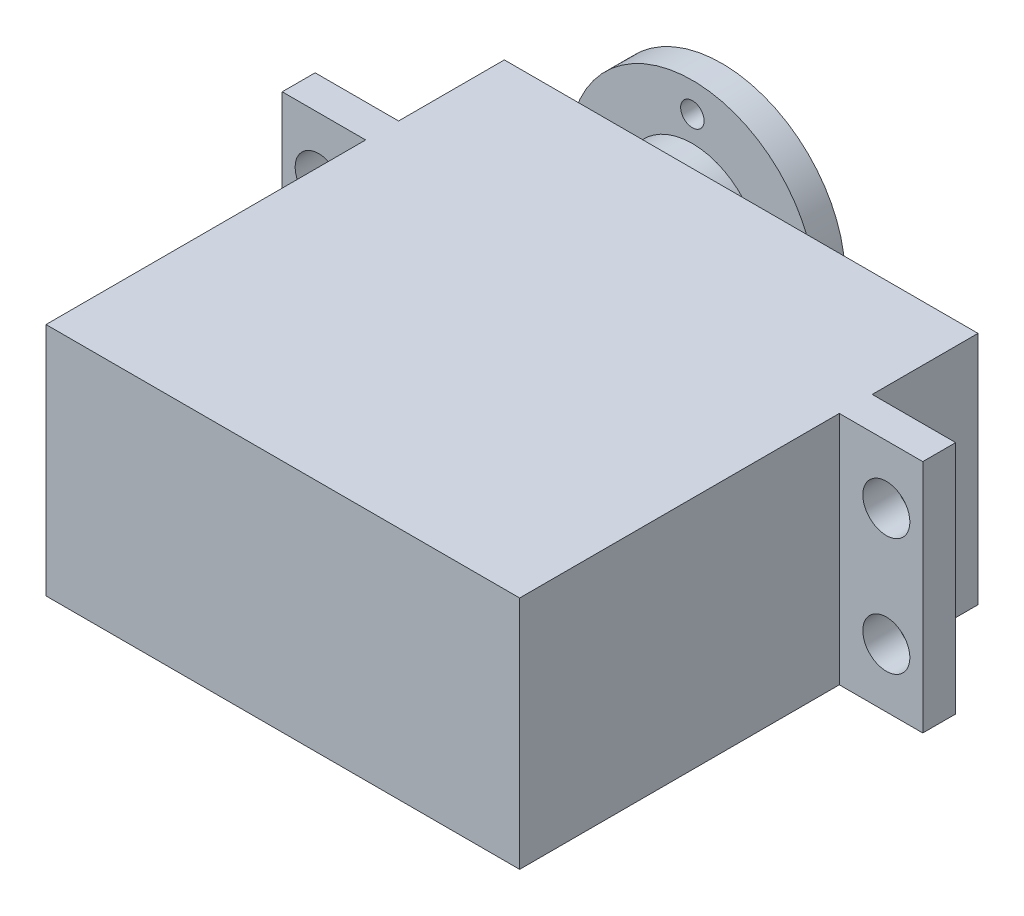
ISO-10303-21;
HEADER;
FILE_DESCRIPTION(('STEP AP214'),'2;1');
FILE_NAME('part.step','',(''),(''),'','','');
FILE_SCHEMA(('AUTOMOTIVE_DESIGN { 1 0 10303 214 1 1 1 1 }'));
ENDSEC;
DATA;
#1=APPLICATION_CONTEXT('core data for automotive mechanical design processes');
#2=APPLICATION_PROTOCOL_DEFINITION('international standard','automotive_design',2000,#1);
#3=PRODUCT_CONTEXT('',#1,'mechanical');
#4=PRODUCT('Part','Part','',(#3));
#5=PRODUCT_RELATED_PRODUCT_CATEGORY('part','',(#4));
#6=PRODUCT_DEFINITION_FORMATION('','',#4);
#7=PRODUCT_DEFINITION_CONTEXT('part definition',#1,'design');
#8=PRODUCT_DEFINITION('design','',#6,#7);
#9=PRODUCT_DEFINITION_SHAPE('','',#8);
#10=(LENGTH_UNIT() NAMED_UNIT(*) SI_UNIT(.MILLI.,.METRE.));
#11=(NAMED_UNIT(*) PLANE_ANGLE_UNIT() SI_UNIT($,.RADIAN.));
#12=(NAMED_UNIT(*) SI_UNIT($,.STERADIAN.) SOLID_ANGLE_UNIT());
#13=UNCERTAINTY_MEASURE_WITH_UNIT(LENGTH_MEASURE(1.E-05),#10,'distance_accuracy_value','');
#14=(GEOMETRIC_REPRESENTATION_CONTEXT(3) GLOBAL_UNCERTAINTY_ASSIGNED_CONTEXT((#13)) GLOBAL_UNIT_ASSIGNED_CONTEXT((#10,
#11,#12)) REPRESENTATION_CONTEXT('',''));
#15=CARTESIAN_POINT('',(0.,0.,0.));
#16=DIRECTION('',(0.,0.,1.));
#17=DIRECTION('',(1.,0.,0.));
#18=AXIS2_PLACEMENT_3D('',#15,#16,#17);
#19=CARTESIAN_POINT('',(-10.15,10.,-28.));
#20=DIRECTION('',(0.,0.,1.));
#21=DIRECTION('',(1.,0.,0.));
#22=AXIS2_PLACEMENT_3D('',#19,#20,#21);
#23=CYLINDRICAL_SURFACE('',#22,5.83746316110564);
#24=CARTESIAN_POINT('',(-10.15,10.,-19.5));
#25=DIRECTION('',(0.,0.,1.));
#26=DIRECTION('',(1.,0.,0.));
#27=AXIS2_PLACEMENT_3D('',#24,#25,#26);
#28=CIRCLE('',#27,5.83746316110564);
#29=CARTESIAN_POINT('',(-4.31253683889436,10.,-19.5));
#30=VERTEX_POINT('',#29);
#31=EDGE_CURVE('E42',#30,#30,#28,.F.);
#32=ORIENTED_EDGE('',*,*,#31,.T.);
#33=EDGE_LOOP('',(#32));
#34=FACE_BOUND('',#33,.T.);
#35=CARTESIAN_POINT('',(-10.15,10.,-25.5));
#36=DIRECTION('',(0.,0.,-1.));
#37=DIRECTION('',(-1.,0.,0.));
#38=AXIS2_PLACEMENT_3D('',#35,#36,#37);
#39=CIRCLE('',#38,5.83746316110564);
#40=CARTESIAN_POINT('',(-15.9874631611056,10.,-25.5));
#41=VERTEX_POINT('',#40);
#42=EDGE_CURVE('E11',#41,#41,#39,.T.);
#43=ORIENTED_EDGE('',*,*,#42,.F.);
#44=EDGE_LOOP('',(#43));
#45=FACE_BOUND('',#44,.T.);
#46=ADVANCED_FACE('F33',(#34,#45),#23,.T.);
#47=CARTESIAN_POINT('',(-20.15,20.,19.5));
#48=DIRECTION('',(1.,0.,0.));
#49=DIRECTION('',(0.,0.,-1.));
#50=AXIS2_PLACEMENT_3D('',#47,#48,#49);
#51=PLANE('',#50);
#52=DIRECTION('',(0.,0.,1.));
#53=VECTOR('',#52,1.);
#54=CARTESIAN_POINT('',(-20.15,0.,19.5));
#55=LINE('',#54,#53);
#56=CARTESIAN_POINT('',(-20.15,0.,-7.69999999999998));
#57=VERTEX_POINT('',#56);
#58=CARTESIAN_POINT('',(-20.15,0.,19.5));
#59=VERTEX_POINT('',#58);
#60=EDGE_CURVE('E155',#57,#59,#55,.T.);
#61=ORIENTED_EDGE('',*,*,#60,.T.);
#62=DIRECTION('',(0.,-1.,0.));
#63=VECTOR('',#62,1.);
#64=CARTESIAN_POINT('',(-20.15,20.,19.5));
#65=LINE('',#64,#63);
#66=CARTESIAN_POINT('',(-20.15,20.,19.5));
#67=VERTEX_POINT('',#66);
#68=EDGE_CURVE('E203',#67,#59,#65,.T.);
#69=ORIENTED_EDGE('',*,*,#68,.F.);
#70=DIRECTION('',(0.,0.,1.));
#71=VECTOR('',#70,1.);
#72=CARTESIAN_POINT('',(-20.15,20.,19.5));
#73=LINE('',#72,#71);
#74=CARTESIAN_POINT('',(-20.15,20.,-7.69999999999998));
#75=VERTEX_POINT('',#74);
#76=EDGE_CURVE('E178',#75,#67,#73,.T.);
#77=ORIENTED_EDGE('',*,*,#76,.F.);
#78=DIRECTION('',(0.,-1.,0.));
#79=VECTOR('',#78,1.);
#80=CARTESIAN_POINT('',(-20.15,20.,-7.69999999999998));
#81=LINE('',#80,#79);
#82=EDGE_CURVE('E151',#75,#57,#81,.T.);
#83=ORIENTED_EDGE('',*,*,#82,.T.);
#84=EDGE_LOOP('',(#61,#69,#77,#83));
#85=FACE_BOUND('',#84,.T.);
#86=ADVANCED_FACE('F35',(#85),#51,.F.);
#87=CARTESIAN_POINT('',(20.15,20.,19.5));
#88=DIRECTION('',(0.,0.,-1.));
#89=DIRECTION('',(-1.,0.,0.));
#90=AXIS2_PLACEMENT_3D('',#87,#88,#89);
#91=PLANE('',#90);
#92=DIRECTION('',(1.,0.,0.));
#93=VECTOR('',#92,1.);
#94=CARTESIAN_POINT('',(20.15,0.,19.5));
#95=LINE('',#94,#93);
#96=CARTESIAN_POINT('',(20.15,0.,19.5));
#97=VERTEX_POINT('',#96);
#98=EDGE_CURVE('E158',#59,#97,#95,.T.);
#99=ORIENTED_EDGE('',*,*,#98,.T.);
#100=DIRECTION('',(0.,-1.,0.));
#101=VECTOR('',#100,1.);
#102=CARTESIAN_POINT('',(20.15,20.,19.5));
#103=LINE('',#102,#101);
#104=CARTESIAN_POINT('',(20.15,20.,19.5));
#105=VERTEX_POINT('',#104);
#106=EDGE_CURVE('E200',#105,#97,#103,.T.);
#107=ORIENTED_EDGE('',*,*,#106,.F.);
#108=DIRECTION('',(1.,0.,0.));
#109=VECTOR('',#108,1.);
#110=CARTESIAN_POINT('',(20.15,20.,19.5));
#111=LINE('',#110,#109);
#112=EDGE_CURVE('E106',#67,#105,#111,.T.);
#113=ORIENTED_EDGE('',*,*,#112,.F.);
#114=ORIENTED_EDGE('',*,*,#68,.T.);
#115=EDGE_LOOP('',(#99,#107,#113,#114));
#116=FACE_BOUND('',#115,.T.);
#117=ADVANCED_FACE('F275',(#116),#91,.F.);
#118=CARTESIAN_POINT('',(20.15,20.,19.5));
#119=DIRECTION('',(-1.,0.,0.));
#120=DIRECTION('',(0.,0.,1.));
#121=AXIS2_PLACEMENT_3D('',#118,#119,#120);
#122=PLANE('',#121);
#123=DIRECTION('',(0.,0.,-1.));
#124=VECTOR('',#123,1.);
#125=CARTESIAN_POINT('',(20.15,0.,19.5));
#126=LINE('',#125,#124);
#127=CARTESIAN_POINT('',(20.15,0.,-7.7));
#128=VERTEX_POINT('',#127);
#129=EDGE_CURVE('E161',#97,#128,#126,.T.);
#130=ORIENTED_EDGE('',*,*,#129,.T.);
#131=DIRECTION('',(0.,-1.,0.));
#132=VECTOR('',#131,1.);
#133=CARTESIAN_POINT('',(20.15,20.,-7.7));
#134=LINE('',#133,#132);
#135=CARTESIAN_POINT('',(20.15,20.,-7.7));
#136=VERTEX_POINT('',#135);
#137=EDGE_CURVE('E197',#136,#128,#134,.T.);
#138=ORIENTED_EDGE('',*,*,#137,.F.);
#139=DIRECTION('',(0.,0.,-1.));
#140=VECTOR('',#139,1.);
#141=CARTESIAN_POINT('',(20.15,20.,19.5));
#142=LINE('',#141,#140);
#143=EDGE_CURVE('E230',#105,#136,#142,.T.);
#144=ORIENTED_EDGE('',*,*,#143,.F.);
#145=ORIENTED_EDGE('',*,*,#106,.T.);
#146=EDGE_LOOP('',(#130,#138,#144,#145));
#147=FACE_BOUND('',#146,.T.);
#148=ADVANCED_FACE('F395',(#147),#122,.F.);
#149=CARTESIAN_POINT('',(20.15,20.,-7.7));
#150=DIRECTION('',(0.,0.,-1.));
#151=DIRECTION('',(-1.,0.,0.));
#152=AXIS2_PLACEMENT_3D('',#149,#150,#151);
#153=PLANE('',#152);
#154=CARTESIAN_POINT('',(24.15,5.,-7.7));
#155=DIRECTION('',(0.,0.,-1.));
#156=DIRECTION('',(-1.,0.,0.));
#157=AXIS2_PLACEMENT_3D('',#154,#155,#156);
#158=CIRCLE('',#157,2.);
#159=CARTESIAN_POINT('',(22.15,5.,-7.7));
#160=VERTEX_POINT('',#159);
#161=EDGE_CURVE('E212',#160,#160,#158,.T.);
#162=ORIENTED_EDGE('',*,*,#161,.T.);
#163=EDGE_LOOP('',(#162));
#164=FACE_BOUND('',#163,.T.);
#165=CARTESIAN_POINT('',(24.15,15.,-7.7));
#166=DIRECTION('',(0.,0.,-1.));
#167=DIRECTION('',(-1.,0.,0.));
#168=AXIS2_PLACEMENT_3D('',#165,#166,#167);
#169=CIRCLE('',#168,2.);
#170=CARTESIAN_POINT('',(22.15,15.,-7.7));
#171=VERTEX_POINT('',#170);
#172=EDGE_CURVE('E159',#171,#171,#169,.T.);
#173=ORIENTED_EDGE('',*,*,#172,.T.);
#174=EDGE_LOOP('',(#173));
#175=FACE_BOUND('',#174,.T.);
#176=DIRECTION('',(1.,0.,0.));
#177=VECTOR('',#176,1.);
#178=CARTESIAN_POINT('',(20.15,0.,-7.7));
#179=LINE('',#178,#177);
#180=CARTESIAN_POINT('',(27.25,0.,-7.70000000000001));
#181=VERTEX_POINT('',#180);
#182=EDGE_CURVE('E163',#128,#181,#179,.T.);
#183=ORIENTED_EDGE('',*,*,#182,.T.);
#184=DIRECTION('',(0.,-1.,0.));
#185=VECTOR('',#184,1.);
#186=CARTESIAN_POINT('',(27.25,20.,-7.70000000000001));
#187=LINE('',#186,#185);
#188=CARTESIAN_POINT('',(27.25,20.,-7.70000000000001));
#189=VERTEX_POINT('',#188);
#190=EDGE_CURVE('E194',#189,#181,#187,.T.);
#191=ORIENTED_EDGE('',*,*,#190,.F.);
#192=DIRECTION('',(1.,0.,0.));
#193=VECTOR('',#192,1.);
#194=CARTESIAN_POINT('',(20.15,20.,-7.7));
#195=LINE('',#194,#193);
#196=EDGE_CURVE('E232',#136,#189,#195,.T.);
#197=ORIENTED_EDGE('',*,*,#196,.F.);
#198=ORIENTED_EDGE('',*,*,#137,.T.);
#199=EDGE_LOOP('',(#183,#191,#197,#198));
#200=FACE_BOUND('',#199,.T.);
#201=ADVANCED_FACE('F391',(#164,#175,#200),#153,.F.);
#202=CARTESIAN_POINT('',(27.25,20.,-10.5));
#203=DIRECTION('',(-1.,0.,0.));
#204=DIRECTION('',(0.,0.,1.));
#205=AXIS2_PLACEMENT_3D('',#202,#203,#204);
#206=PLANE('',#205);
#207=DIRECTION('',(0.,0.,-1.));
#208=VECTOR('',#207,1.);
#209=CARTESIAN_POINT('',(27.25,0.,-10.5));
#210=LINE('',#209,#208);
#211=CARTESIAN_POINT('',(27.25,0.,-10.5));
#212=VERTEX_POINT('',#211);
#213=EDGE_CURVE('E165',#181,#212,#210,.T.);
#214=ORIENTED_EDGE('',*,*,#213,.T.);
#215=DIRECTION('',(0.,-1.,0.));
#216=VECTOR('',#215,1.);
#217=CARTESIAN_POINT('',(27.25,20.,-10.5));
#218=LINE('',#217,#216);
#219=CARTESIAN_POINT('',(27.25,20.,-10.5));
#220=VERTEX_POINT('',#219);
#221=EDGE_CURVE('E191',#220,#212,#218,.T.);
#222=ORIENTED_EDGE('',*,*,#221,.F.);
#223=DIRECTION('',(0.,0.,-1.));
#224=VECTOR('',#223,1.);
#225=CARTESIAN_POINT('',(27.25,20.,-10.5));
#226=LINE('',#225,#224);
#227=EDGE_CURVE('E234',#189,#220,#226,.T.);
#228=ORIENTED_EDGE('',*,*,#227,.F.);
#229=ORIENTED_EDGE('',*,*,#190,.T.);
#230=EDGE_LOOP('',(#214,#222,#228,#229));
#231=FACE_BOUND('',#230,.T.);
#232=ADVANCED_FACE('F387',(#231),#206,.F.);
#233=CARTESIAN_POINT('',(20.15,20.,-10.5));
#234=DIRECTION('',(0.,0.,1.));
#235=DIRECTION('',(1.,0.,0.));
#236=AXIS2_PLACEMENT_3D('',#233,#234,#235);
#237=PLANE('',#236);
#238=CARTESIAN_POINT('',(24.15,5.,-10.5));
#239=DIRECTION('',(0.,0.,-1.));
#240=DIRECTION('',(1.,0.,0.));
#241=AXIS2_PLACEMENT_3D('',#238,#239,#240);
#242=CIRCLE('',#241,2.);
#243=CARTESIAN_POINT('',(26.15,5.,-10.5));
#244=VERTEX_POINT('',#243);
#245=EDGE_CURVE('E210',#244,#244,#242,.T.);
#246=ORIENTED_EDGE('',*,*,#245,.F.);
#247=EDGE_LOOP('',(#246));
#248=FACE_BOUND('',#247,.T.);
#249=CARTESIAN_POINT('',(24.15,15.,-10.5));
#250=DIRECTION('',(0.,0.,-1.));
#251=DIRECTION('',(-1.,0.,0.));
#252=AXIS2_PLACEMENT_3D('',#249,#250,#251);
#253=CIRCLE('',#252,2.);
#254=CARTESIAN_POINT('',(22.15,15.,-10.5));
#255=VERTEX_POINT('',#254);
#256=EDGE_CURVE('E216',#255,#255,#253,.T.);
#257=ORIENTED_EDGE('',*,*,#256,.F.);
#258=EDGE_LOOP('',(#257));
#259=FACE_BOUND('',#258,.T.);
#260=DIRECTION('',(-1.,0.,0.));
#261=VECTOR('',#260,1.);
#262=CARTESIAN_POINT('',(20.15,0.,-10.5));
#263=LINE('',#262,#261);
#264=CARTESIAN_POINT('',(20.15,0.,-10.5));
#265=VERTEX_POINT('',#264);
#266=EDGE_CURVE('E167',#212,#265,#263,.T.);
#267=ORIENTED_EDGE('',*,*,#266,.T.);
#268=DIRECTION('',(0.,-1.,0.));
#269=VECTOR('',#268,1.);
#270=CARTESIAN_POINT('',(20.15,20.,-10.5));
#271=LINE('',#270,#269);
#272=CARTESIAN_POINT('',(20.15,20.,-10.5));
#273=VERTEX_POINT('',#272);
#274=EDGE_CURVE('E188',#273,#265,#271,.T.);
#275=ORIENTED_EDGE('',*,*,#274,.F.);
#276=DIRECTION('',(-1.,0.,0.));
#277=VECTOR('',#276,1.);
#278=CARTESIAN_POINT('',(20.15,20.,-10.5));
#279=LINE('',#278,#277);
#280=EDGE_CURVE('E236',#220,#273,#279,.T.);
#281=ORIENTED_EDGE('',*,*,#280,.F.);
#282=ORIENTED_EDGE('',*,*,#221,.T.);
#283=EDGE_LOOP('',(#267,#275,#281,#282));
#284=FACE_BOUND('',#283,.T.);
#285=ADVANCED_FACE('F383',(#248,#259,#284),#237,.F.);
#286=CARTESIAN_POINT('',(20.15,20.,-10.5));
#287=DIRECTION('',(-1.,0.,0.));
#288=DIRECTION('',(0.,0.,1.));
#289=AXIS2_PLACEMENT_3D('',#286,#287,#288);
#290=PLANE('',#289);
#291=DIRECTION('',(0.,0.,-1.));
#292=VECTOR('',#291,1.);
#293=CARTESIAN_POINT('',(20.15,0.,-10.5));
#294=LINE('',#293,#292);
#295=CARTESIAN_POINT('',(20.15,0.,-19.5));
#296=VERTEX_POINT('',#295);
#297=EDGE_CURVE('E169',#265,#296,#294,.T.);
#298=ORIENTED_EDGE('',*,*,#297,.T.);
#299=DIRECTION('',(0.,-1.,0.));
#300=VECTOR('',#299,1.);
#301=CARTESIAN_POINT('',(20.15,20.,-19.5));
#302=LINE('',#301,#300);
#303=CARTESIAN_POINT('',(20.15,20.,-19.5));
#304=VERTEX_POINT('',#303);
#305=EDGE_CURVE('E185',#304,#296,#302,.T.);
#306=ORIENTED_EDGE('',*,*,#305,.F.);
#307=DIRECTION('',(0.,0.,-1.));
#308=VECTOR('',#307,1.);
#309=CARTESIAN_POINT('',(20.15,20.,-10.5));
#310=LINE('',#309,#308);
#311=EDGE_CURVE('E238',#273,#304,#310,.T.);
#312=ORIENTED_EDGE('',*,*,#311,.F.);
#313=ORIENTED_EDGE('',*,*,#274,.T.);
#314=EDGE_LOOP('',(#298,#306,#312,#313));
#315=FACE_BOUND('',#314,.T.);
#316=ADVANCED_FACE('F379',(#315),#290,.F.);
#317=CARTESIAN_POINT('',(20.15,20.,-19.5));
#318=DIRECTION('',(0.,0.,1.));
#319=DIRECTION('',(1.,0.,0.));
#320=AXIS2_PLACEMENT_3D('',#317,#318,#319);
#321=PLANE('',#320);
#322=ORIENTED_EDGE('',*,*,#31,.F.);
#323=EDGE_LOOP('',(#322));
#324=FACE_BOUND('',#323,.T.);
#325=DIRECTION('',(-1.,0.,0.));
#326=VECTOR('',#325,1.);
#327=CARTESIAN_POINT('',(20.15,0.,-19.5));
#328=LINE('',#327,#326);
#329=CARTESIAN_POINT('',(-20.15,0.,-19.5));
#330=VERTEX_POINT('',#329);
#331=EDGE_CURVE('E171',#296,#330,#328,.T.);
#332=ORIENTED_EDGE('',*,*,#331,.T.);
#333=DIRECTION('',(0.,-1.,0.));
#334=VECTOR('',#333,1.);
#335=CARTESIAN_POINT('',(-20.15,20.,-19.5));
#336=LINE('',#335,#334);
#337=CARTESIAN_POINT('',(-20.15,20.,-19.5));
#338=VERTEX_POINT('',#337);
#339=EDGE_CURVE('E182',#338,#330,#336,.T.);
#340=ORIENTED_EDGE('',*,*,#339,.F.);
#341=DIRECTION('',(-1.,0.,0.));
#342=VECTOR('',#341,1.);
#343=CARTESIAN_POINT('',(20.15,20.,-19.5));
#344=LINE('',#343,#342);
#345=EDGE_CURVE('E240',#304,#338,#344,.T.);
#346=ORIENTED_EDGE('',*,*,#345,.F.);
#347=ORIENTED_EDGE('',*,*,#305,.T.);
#348=EDGE_LOOP('',(#332,#340,#346,#347));
#349=FACE_BOUND('',#348,.T.);
#350=ADVANCED_FACE('F246',(#324,#349),#321,.F.);
#351=CARTESIAN_POINT('',(-20.15,20.,-10.5));
#352=DIRECTION('',(1.,0.,0.));
#353=DIRECTION('',(0.,0.,-1.));
#354=AXIS2_PLACEMENT_3D('',#351,#352,#353);
#355=PLANE('',#354);
#356=DIRECTION('',(0.,0.,1.));
#357=VECTOR('',#356,1.);
#358=CARTESIAN_POINT('',(-20.15,0.,-10.5));
#359=LINE('',#358,#357);
#360=CARTESIAN_POINT('',(-20.15,0.,-10.5));
#361=VERTEX_POINT('',#360);
#362=EDGE_CURVE('E173',#330,#361,#359,.T.);
#363=ORIENTED_EDGE('',*,*,#362,.T.);
#364=DIRECTION('',(0.,-1.,0.));
#365=VECTOR('',#364,1.);
#366=CARTESIAN_POINT('',(-20.15,20.,-10.5));
#367=LINE('',#366,#365);
#368=CARTESIAN_POINT('',(-20.15,20.,-10.5));
#369=VERTEX_POINT('',#368);
#370=EDGE_CURVE('E146',#369,#361,#367,.T.);
#371=ORIENTED_EDGE('',*,*,#370,.F.);
#372=DIRECTION('',(0.,0.,1.));
#373=VECTOR('',#372,1.);
#374=CARTESIAN_POINT('',(-20.15,20.,-10.5));
#375=LINE('',#374,#373);
#376=EDGE_CURVE('E137',#338,#369,#375,.T.);
#377=ORIENTED_EDGE('',*,*,#376,.F.);
#378=ORIENTED_EDGE('',*,*,#339,.T.);
#379=EDGE_LOOP('',(#363,#371,#377,#378));
#380=FACE_BOUND('',#379,.T.);
#381=ADVANCED_FACE('F250',(#380),#355,.F.);
#382=CARTESIAN_POINT('',(-20.15,20.,-10.5));
#383=DIRECTION('',(0.,0.,1.));
#384=DIRECTION('',(1.,0.,0.));
#385=AXIS2_PLACEMENT_3D('',#382,#383,#384);
#386=PLANE('',#385);
#387=CARTESIAN_POINT('',(-24.15,5.,-10.5));
#388=DIRECTION('',(0.,0.,-1.));
#389=DIRECTION('',(-1.,0.,0.));
#390=AXIS2_PLACEMENT_3D('',#387,#388,#389);
#391=CIRCLE('',#390,2.);
#392=CARTESIAN_POINT('',(-26.15,5.,-10.5));
#393=VERTEX_POINT('',#392);
#394=EDGE_CURVE('E362',#393,#393,#391,.T.);
#395=ORIENTED_EDGE('',*,*,#394,.F.);
#396=EDGE_LOOP('',(#395));
#397=FACE_BOUND('',#396,.T.);
#398=CARTESIAN_POINT('',(-24.15,15.,-10.5));
#399=DIRECTION('',(0.,0.,-1.));
#400=DIRECTION('',(1.,0.,0.));
#401=AXIS2_PLACEMENT_3D('',#398,#399,#400);
#402=CIRCLE('',#401,2.);
#403=CARTESIAN_POINT('',(-22.15,15.,-10.5));
#404=VERTEX_POINT('',#403);
#405=EDGE_CURVE('E223',#404,#404,#402,.T.);
#406=ORIENTED_EDGE('',*,*,#405,.F.);
#407=EDGE_LOOP('',(#406));
#408=FACE_BOUND('',#407,.T.);
#409=DIRECTION('',(-1.,0.,0.));
#410=VECTOR('',#409,1.);
#411=CARTESIAN_POINT('',(-20.15,0.,-10.5));
#412=LINE('',#411,#410);
#413=CARTESIAN_POINT('',(-27.25,0.,-10.5));
#414=VERTEX_POINT('',#413);
#415=EDGE_CURVE('E145',#361,#414,#412,.T.);
#416=ORIENTED_EDGE('',*,*,#415,.T.);
#417=DIRECTION('',(0.,-1.,0.));
#418=VECTOR('',#417,1.);
#419=CARTESIAN_POINT('',(-27.25,20.,-10.5));
#420=LINE('',#419,#418);
#421=CARTESIAN_POINT('',(-27.25,20.,-10.5));
#422=VERTEX_POINT('',#421);
#423=EDGE_CURVE('E142',#422,#414,#420,.T.);
#424=ORIENTED_EDGE('',*,*,#423,.F.);
#425=DIRECTION('',(-1.,0.,0.));
#426=VECTOR('',#425,1.);
#427=CARTESIAN_POINT('',(-20.15,20.,-10.5));
#428=LINE('',#427,#426);
#429=EDGE_CURVE('E131',#369,#422,#428,.T.);
#430=ORIENTED_EDGE('',*,*,#429,.F.);
#431=ORIENTED_EDGE('',*,*,#370,.T.);
#432=EDGE_LOOP('',(#416,#424,#430,#431));
#433=FACE_BOUND('',#432,.T.);
#434=ADVANCED_FACE('F143',(#397,#408,#433),#386,.F.);
#435=CARTESIAN_POINT('',(-27.25,20.,-10.5));
#436=DIRECTION('',(1.,0.,0.));
#437=DIRECTION('',(0.,0.,-1.));
#438=AXIS2_PLACEMENT_3D('',#435,#436,#437);
#439=PLANE('',#438);
#440=DIRECTION('',(0.,0.,1.));
#441=VECTOR('',#440,1.);
#442=CARTESIAN_POINT('',(-27.25,0.,-10.5));
#443=LINE('',#442,#441);
#444=CARTESIAN_POINT('',(-27.25,0.,-7.69999999999998));
#445=VERTEX_POINT('',#444);
#446=EDGE_CURVE('E91',#414,#445,#443,.T.);
#447=ORIENTED_EDGE('',*,*,#446,.T.);
#448=DIRECTION('',(0.,-1.,0.));
#449=VECTOR('',#448,1.);
#450=CARTESIAN_POINT('',(-27.25,20.,-7.69999999999998));
#451=LINE('',#450,#449);
#452=CARTESIAN_POINT('',(-27.25,20.,-7.69999999999998));
#453=VERTEX_POINT('',#452);
#454=EDGE_CURVE('E147',#453,#445,#451,.T.);
#455=ORIENTED_EDGE('',*,*,#454,.F.);
#456=DIRECTION('',(0.,0.,1.));
#457=VECTOR('',#456,1.);
#458=CARTESIAN_POINT('',(-27.25,20.,-10.5));
#459=LINE('',#458,#457);
#460=EDGE_CURVE('E135',#422,#453,#459,.T.);
#461=ORIENTED_EDGE('',*,*,#460,.F.);
#462=ORIENTED_EDGE('',*,*,#423,.T.);
#463=EDGE_LOOP('',(#447,#455,#461,#462));
#464=FACE_BOUND('',#463,.T.);
#465=ADVANCED_FACE('F149',(#464),#439,.F.);
#466=CARTESIAN_POINT('',(-20.15,20.,-7.69999999999998));
#467=DIRECTION('',(0.,0.,-1.));
#468=DIRECTION('',(-1.,0.,0.));
#469=AXIS2_PLACEMENT_3D('',#466,#467,#468);
#470=PLANE('',#469);
#471=CARTESIAN_POINT('',(-24.15,5.,-7.69999999999998));
#472=DIRECTION('',(0.,0.,-1.));
#473=DIRECTION('',(-1.,0.,0.));
#474=AXIS2_PLACEMENT_3D('',#471,#472,#473);
#475=CIRCLE('',#474,2.);
#476=CARTESIAN_POINT('',(-26.15,5.,-7.69999999999998));
#477=VERTEX_POINT('',#476);
#478=EDGE_CURVE('E209',#477,#477,#475,.T.);
#479=ORIENTED_EDGE('',*,*,#478,.T.);
#480=EDGE_LOOP('',(#479));
#481=FACE_BOUND('',#480,.T.);
#482=CARTESIAN_POINT('',(-24.15,15.,-7.69999999999998));
#483=DIRECTION('',(0.,0.,-1.));
#484=DIRECTION('',(-1.,0.,0.));
#485=AXIS2_PLACEMENT_3D('',#482,#483,#484);
#486=CIRCLE('',#485,2.);
#487=CARTESIAN_POINT('',(-26.15,15.,-7.69999999999998));
#488=VERTEX_POINT('',#487);
#489=EDGE_CURVE('E207',#488,#488,#486,.T.);
#490=ORIENTED_EDGE('',*,*,#489,.T.);
#491=EDGE_LOOP('',(#490));
#492=FACE_BOUND('',#491,.T.);
#493=DIRECTION('',(1.,0.,0.));
#494=VECTOR('',#493,1.);
#495=CARTESIAN_POINT('',(-20.15,0.,-7.69999999999998));
#496=LINE('',#495,#494);
#497=EDGE_CURVE('E97',#445,#57,#496,.T.);
#498=ORIENTED_EDGE('',*,*,#497,.T.);
#499=ORIENTED_EDGE('',*,*,#82,.F.);
#500=DIRECTION('',(1.,0.,0.));
#501=VECTOR('',#500,1.);
#502=CARTESIAN_POINT('',(-20.15,20.,-7.69999999999998));
#503=LINE('',#502,#501);
#504=EDGE_CURVE('E50',#453,#75,#503,.T.);
#505=ORIENTED_EDGE('',*,*,#504,.F.);
#506=ORIENTED_EDGE('',*,*,#454,.T.);
#507=EDGE_LOOP('',(#498,#499,#505,#506));
#508=FACE_BOUND('',#507,.T.);
#509=ADVANCED_FACE('F258',(#481,#492,#508),#470,.F.);
#510=CARTESIAN_POINT('',(0.,20.,0.));
#511=DIRECTION('',(0.,1.,0.));
#512=DIRECTION('',(0.,0.,1.));
#513=AXIS2_PLACEMENT_3D('',#510,#511,#512);
#514=PLANE('',#513);
#515=ORIENTED_EDGE('',*,*,#76,.T.);
#516=ORIENTED_EDGE('',*,*,#112,.T.);
#517=ORIENTED_EDGE('',*,*,#143,.T.);
#518=ORIENTED_EDGE('',*,*,#196,.T.);
#519=ORIENTED_EDGE('',*,*,#227,.T.);
#520=ORIENTED_EDGE('',*,*,#280,.T.);
#521=ORIENTED_EDGE('',*,*,#311,.T.);
#522=ORIENTED_EDGE('',*,*,#345,.T.);
#523=ORIENTED_EDGE('',*,*,#376,.T.);
#524=ORIENTED_EDGE('',*,*,#429,.T.);
#525=ORIENTED_EDGE('',*,*,#460,.T.);
#526=ORIENTED_EDGE('',*,*,#504,.T.);
#527=EDGE_LOOP('',(#515,#516,#517,#518,#519,#520,#521,#522,#523,#524,#525,#526));
#528=FACE_BOUND('',#527,.T.);
#529=ADVANCED_FACE('F133',(#528),#514,.T.);
#530=CARTESIAN_POINT('',(0.,0.,0.));
#531=DIRECTION('',(0.,1.,0.));
#532=DIRECTION('',(0.,0.,1.));
#533=AXIS2_PLACEMENT_3D('',#530,#531,#532);
#534=PLANE('',#533);
#535=ORIENTED_EDGE('',*,*,#60,.F.);
#536=ORIENTED_EDGE('',*,*,#497,.F.);
#537=ORIENTED_EDGE('',*,*,#446,.F.);
#538=ORIENTED_EDGE('',*,*,#415,.F.);
#539=ORIENTED_EDGE('',*,*,#362,.F.);
#540=ORIENTED_EDGE('',*,*,#331,.F.);
#541=ORIENTED_EDGE('',*,*,#297,.F.);
#542=ORIENTED_EDGE('',*,*,#266,.F.);
#543=ORIENTED_EDGE('',*,*,#213,.F.);
#544=ORIENTED_EDGE('',*,*,#182,.F.);
#545=ORIENTED_EDGE('',*,*,#129,.F.);
#546=ORIENTED_EDGE('',*,*,#98,.F.);
#547=EDGE_LOOP('',(#535,#536,#537,#538,#539,#540,#541,#542,#543,#544,#545,#546));
#548=FACE_BOUND('',#547,.T.);
#549=ADVANCED_FACE('F253',(#548),#534,.F.);
#550=CARTESIAN_POINT('',(24.15,15.,-0.499999999999987));
#551=DIRECTION('',(0.,0.,-1.));
#552=DIRECTION('',(-1.,0.,0.));
#553=AXIS2_PLACEMENT_3D('',#550,#551,#552);
#554=CYLINDRICAL_SURFACE('',#553,2.);
#555=ORIENTED_EDGE('',*,*,#256,.T.);
#556=EDGE_LOOP('',(#555));
#557=FACE_BOUND('',#556,.T.);
#558=ORIENTED_EDGE('',*,*,#172,.F.);
#559=EDGE_LOOP('',(#558));
#560=FACE_BOUND('',#559,.T.);
#561=ADVANCED_FACE('F281',(#557,#560),#554,.F.);
#562=CARTESIAN_POINT('',(-24.15,15.,-0.5));
#563=DIRECTION('',(0.,0.,-1.));
#564=DIRECTION('',(-1.,0.,0.));
#565=AXIS2_PLACEMENT_3D('',#562,#563,#564);
#566=CYLINDRICAL_SURFACE('',#565,2.);
#567=ORIENTED_EDGE('',*,*,#405,.T.);
#568=EDGE_LOOP('',(#567));
#569=FACE_BOUND('',#568,.T.);
#570=ORIENTED_EDGE('',*,*,#489,.F.);
#571=EDGE_LOOP('',(#570));
#572=FACE_BOUND('',#571,.T.);
#573=ADVANCED_FACE('F285',(#569,#572),#566,.F.);
#574=CARTESIAN_POINT('',(-24.15,5.,-0.5));
#575=DIRECTION('',(0.,0.,-1.));
#576=DIRECTION('',(-1.,0.,0.));
#577=AXIS2_PLACEMENT_3D('',#574,#575,#576);
#578=CYLINDRICAL_SURFACE('',#577,2.);
#579=ORIENTED_EDGE('',*,*,#394,.T.);
#580=EDGE_LOOP('',(#579));
#581=FACE_BOUND('',#580,.T.);
#582=ORIENTED_EDGE('',*,*,#478,.F.);
#583=EDGE_LOOP('',(#582));
#584=FACE_BOUND('',#583,.T.);
#585=ADVANCED_FACE('F290',(#581,#584),#578,.F.);
#586=CARTESIAN_POINT('',(24.15,5.,-0.499999999999987));
#587=DIRECTION('',(0.,0.,-1.));
#588=DIRECTION('',(-1.,0.,0.));
#589=AXIS2_PLACEMENT_3D('',#586,#587,#588);
#590=CYLINDRICAL_SURFACE('',#589,2.);
#591=ORIENTED_EDGE('',*,*,#245,.T.);
#592=EDGE_LOOP('',(#591));
#593=FACE_BOUND('',#592,.T.);
#594=ORIENTED_EDGE('',*,*,#161,.F.);
#595=EDGE_LOOP('',(#594));
#596=FACE_BOUND('',#595,.T.);
#597=ADVANCED_FACE('F297',(#593,#596),#590,.F.);
#598=CARTESIAN_POINT('',(-10.15,10.,-25.5));
#599=DIRECTION('',(0.,0.,-1.));
#600=DIRECTION('',(-1.,0.,0.));
#601=AXIS2_PLACEMENT_3D('',#598,#599,#600);
#602=CYLINDRICAL_SURFACE('',#601,10.5);
#603=CARTESIAN_POINT('',(-10.15,10.,-25.5));
#604=DIRECTION('',(0.,0.,-1.));
#605=DIRECTION('',(-1.,0.,0.));
#606=AXIS2_PLACEMENT_3D('',#603,#604,#605);
#607=CIRCLE('',#606,10.5);
#608=CARTESIAN_POINT('',(-20.65,10.,-25.5));
#609=VERTEX_POINT('',#608);
#610=EDGE_CURVE('E356',#609,#609,#607,.T.);
#611=ORIENTED_EDGE('',*,*,#610,.T.);
#612=EDGE_LOOP('',(#611));
#613=FACE_BOUND('',#612,.T.);
#614=CARTESIAN_POINT('',(-10.15,10.,-28.));
#615=DIRECTION('',(0.,0.,-1.));
#616=DIRECTION('',(-1.,0.,0.));
#617=AXIS2_PLACEMENT_3D('',#614,#615,#616);
#618=CIRCLE('',#617,10.5);
#619=CARTESIAN_POINT('',(-20.65,10.,-28.));
#620=VERTEX_POINT('',#619);
#621=EDGE_CURVE('E355',#620,#620,#618,.T.);
#622=ORIENTED_EDGE('',*,*,#621,.F.);
#623=EDGE_LOOP('',(#622));
#624=FACE_BOUND('',#623,.T.);
#625=ADVANCED_FACE('F301',(#613,#624),#602,.T.);
#626=CARTESIAN_POINT('',(-10.15,10.,-25.5));
#627=DIRECTION('',(0.,0.,-1.));
#628=DIRECTION('',(-1.,0.,0.));
#629=AXIS2_PLACEMENT_3D('',#626,#627,#628);
#630=PLANE('',#629);
#631=CARTESIAN_POINT('',(-18.15,10.,-25.5));
#632=DIRECTION('',(0.,0.,-1.));
#633=DIRECTION('',(-1.,0.,0.));
#634=AXIS2_PLACEMENT_3D('',#631,#632,#633);
#635=CIRCLE('',#634,1.);
#636=CARTESIAN_POINT('',(-19.15,10.,-25.5));
#637=VERTEX_POINT('',#636);
#638=EDGE_CURVE('E333',#637,#637,#635,.F.);
#639=ORIENTED_EDGE('',*,*,#638,.F.);
#640=EDGE_LOOP('',(#639));
#641=FACE_BOUND('',#640,.T.);
#642=CARTESIAN_POINT('',(-2.15,10.,-25.5));
#643=DIRECTION('',(0.,0.,-1.));
#644=DIRECTION('',(-1.,0.,0.));
#645=AXIS2_PLACEMENT_3D('',#642,#643,#644);
#646=CIRCLE('',#645,1.);
#647=CARTESIAN_POINT('',(-3.15,10.,-25.5));
#648=VERTEX_POINT('',#647);
#649=EDGE_CURVE('E339',#648,#648,#646,.F.);
#650=ORIENTED_EDGE('',*,*,#649,.F.);
#651=EDGE_LOOP('',(#650));
#652=FACE_BOUND('',#651,.T.);
#653=CARTESIAN_POINT('',(-10.15,2.,-25.5));
#654=DIRECTION('',(0.,0.,-1.));
#655=DIRECTION('',(-1.,0.,0.));
#656=AXIS2_PLACEMENT_3D('',#653,#654,#655);
#657=CIRCLE('',#656,1.);
#658=CARTESIAN_POINT('',(-11.15,2.,-25.5));
#659=VERTEX_POINT('',#658);
#660=EDGE_CURVE('E345',#659,#659,#657,.F.);
#661=ORIENTED_EDGE('',*,*,#660,.F.);
#662=EDGE_LOOP('',(#661));
#663=FACE_BOUND('',#662,.T.);
#664=CARTESIAN_POINT('',(-10.15,18.,-25.5));
#665=DIRECTION('',(0.,0.,-1.));
#666=DIRECTION('',(-1.,0.,0.));
#667=AXIS2_PLACEMENT_3D('',#664,#665,#666);
#668=CIRCLE('',#667,1.);
#669=CARTESIAN_POINT('',(-11.15,18.,-25.5));
#670=VERTEX_POINT('',#669);
#671=EDGE_CURVE('E336',#670,#670,#668,.F.);
#672=ORIENTED_EDGE('',*,*,#671,.F.);
#673=EDGE_LOOP('',(#672));
#674=FACE_BOUND('',#673,.T.);
#675=ORIENTED_EDGE('',*,*,#42,.T.);
#676=EDGE_LOOP('',(#675));
#677=FACE_BOUND('',#676,.T.);
#678=ORIENTED_EDGE('',*,*,#610,.F.);
#679=EDGE_LOOP('',(#678));
#680=FACE_BOUND('',#679,.T.);
#681=ADVANCED_FACE('F305',(#641,#652,#663,#674,#677,#680),#630,.F.);
#682=CARTESIAN_POINT('',(-10.15,10.,-28.));
#683=DIRECTION('',(0.,0.,-1.));
#684=DIRECTION('',(-1.,0.,0.));
#685=AXIS2_PLACEMENT_3D('',#682,#683,#684);
#686=PLANE('',#685);
#687=CARTESIAN_POINT('',(-18.15,10.,-28.));
#688=DIRECTION('',(0.,0.,-1.));
#689=DIRECTION('',(-1.,0.,0.));
#690=AXIS2_PLACEMENT_3D('',#687,#688,#689);
#691=CIRCLE('',#690,1.);
#692=CARTESIAN_POINT('',(-19.15,10.,-28.));
#693=VERTEX_POINT('',#692);
#694=EDGE_CURVE('E330',#693,#693,#691,.T.);
#695=ORIENTED_EDGE('',*,*,#694,.F.);
#696=EDGE_LOOP('',(#695));
#697=FACE_BOUND('',#696,.T.);
#698=CARTESIAN_POINT('',(-2.15,10.,-28.));
#699=DIRECTION('',(0.,0.,-1.));
#700=DIRECTION('',(1.,0.,0.));
#701=AXIS2_PLACEMENT_3D('',#698,#699,#700);
#702=CIRCLE('',#701,1.);
#703=CARTESIAN_POINT('',(-1.15,10.,-28.));
#704=VERTEX_POINT('',#703);
#705=EDGE_CURVE('E334',#704,#704,#702,.T.);
#706=ORIENTED_EDGE('',*,*,#705,.F.);
#707=EDGE_LOOP('',(#706));
#708=FACE_BOUND('',#707,.T.);
#709=CARTESIAN_POINT('',(-10.15,2.,-28.));
#710=DIRECTION('',(0.,0.,-1.));
#711=DIRECTION('',(1.,0.,0.));
#712=AXIS2_PLACEMENT_3D('',#709,#710,#711);
#713=CIRCLE('',#712,1.);
#714=CARTESIAN_POINT('',(-9.15,2.,-28.));
#715=VERTEX_POINT('',#714);
#716=EDGE_CURVE('E343',#715,#715,#713,.T.);
#717=ORIENTED_EDGE('',*,*,#716,.F.);
#718=EDGE_LOOP('',(#717));
#719=FACE_BOUND('',#718,.T.);
#720=CARTESIAN_POINT('',(-10.15,18.,-28.));
#721=DIRECTION('',(0.,0.,-1.));
#722=DIRECTION('',(-1.,0.,0.));
#723=AXIS2_PLACEMENT_3D('',#720,#721,#722);
#724=CIRCLE('',#723,1.);
#725=CARTESIAN_POINT('',(-11.15,18.,-28.));
#726=VERTEX_POINT('',#725);
#727=EDGE_CURVE('E352',#726,#726,#724,.T.);
#728=ORIENTED_EDGE('',*,*,#727,.F.);
#729=EDGE_LOOP('',(#728));
#730=FACE_BOUND('',#729,.T.);
#731=ORIENTED_EDGE('',*,*,#621,.T.);
#732=EDGE_LOOP('',(#731));
#733=FACE_BOUND('',#732,.T.);
#734=ADVANCED_FACE('F278',(#697,#708,#719,#730,#733),#686,.T.);
#735=CARTESIAN_POINT('',(-10.15,18.,19.501));
#736=DIRECTION('',(0.,0.,-1.));
#737=DIRECTION('',(-1.,0.,0.));
#738=AXIS2_PLACEMENT_3D('',#735,#736,#737);
#739=CYLINDRICAL_SURFACE('',#738,1.);
#740=ORIENTED_EDGE('',*,*,#727,.T.);
#741=EDGE_LOOP('',(#740));
#742=FACE_BOUND('',#741,.T.);
#743=ORIENTED_EDGE('',*,*,#671,.T.);
#744=EDGE_LOOP('',(#743));
#745=FACE_BOUND('',#744,.T.);
#746=ADVANCED_FACE('F310',(#742,#745),#739,.F.);
#747=CARTESIAN_POINT('',(-10.15,2.,19.501));
#748=DIRECTION('',(0.,0.,-1.));
#749=DIRECTION('',(-1.,0.,0.));
#750=AXIS2_PLACEMENT_3D('',#747,#748,#749);
#751=CYLINDRICAL_SURFACE('',#750,1.);
#752=ORIENTED_EDGE('',*,*,#716,.T.);
#753=EDGE_LOOP('',(#752));
#754=FACE_BOUND('',#753,.T.);
#755=ORIENTED_EDGE('',*,*,#660,.T.);
#756=EDGE_LOOP('',(#755));
#757=FACE_BOUND('',#756,.T.);
#758=ADVANCED_FACE('F313',(#754,#757),#751,.F.);
#759=CARTESIAN_POINT('',(-2.15,10.,19.501));
#760=DIRECTION('',(0.,0.,-1.));
#761=DIRECTION('',(-1.,0.,0.));
#762=AXIS2_PLACEMENT_3D('',#759,#760,#761);
#763=CYLINDRICAL_SURFACE('',#762,1.);
#764=ORIENTED_EDGE('',*,*,#705,.T.);
#765=EDGE_LOOP('',(#764));
#766=FACE_BOUND('',#765,.T.);
#767=ORIENTED_EDGE('',*,*,#649,.T.);
#768=EDGE_LOOP('',(#767));
#769=FACE_BOUND('',#768,.T.);
#770=ADVANCED_FACE('F317',(#766,#769),#763,.F.);
#771=CARTESIAN_POINT('',(-18.15,10.,19.501));
#772=DIRECTION('',(0.,0.,-1.));
#773=DIRECTION('',(-1.,0.,0.));
#774=AXIS2_PLACEMENT_3D('',#771,#772,#773);
#775=CYLINDRICAL_SURFACE('',#774,1.);
#776=ORIENTED_EDGE('',*,*,#694,.T.);
#777=EDGE_LOOP('',(#776));
#778=FACE_BOUND('',#777,.T.);
#779=ORIENTED_EDGE('',*,*,#638,.T.);
#780=EDGE_LOOP('',(#779));
#781=FACE_BOUND('',#780,.T.);
#782=ADVANCED_FACE('F321',(#778,#781),#775,.F.);
#783=CLOSED_SHELL('',(#46,#86,#117,#148,#201,#232,#285,#316,#350,#381,#434,#465,#509,#529,#549,
#561,#573,#585,#597,#625,#681,#734,#746,#758,#770,#782));
#784=MANIFOLD_SOLID_BREP('B2',#783);
#785=ADVANCED_BREP_SHAPE_REPRESENTATION('',(#18,#784),#14);
#786=SHAPE_DEFINITION_REPRESENTATION(#9,#785);
ENDSEC;
END-ISO-10303-21;
